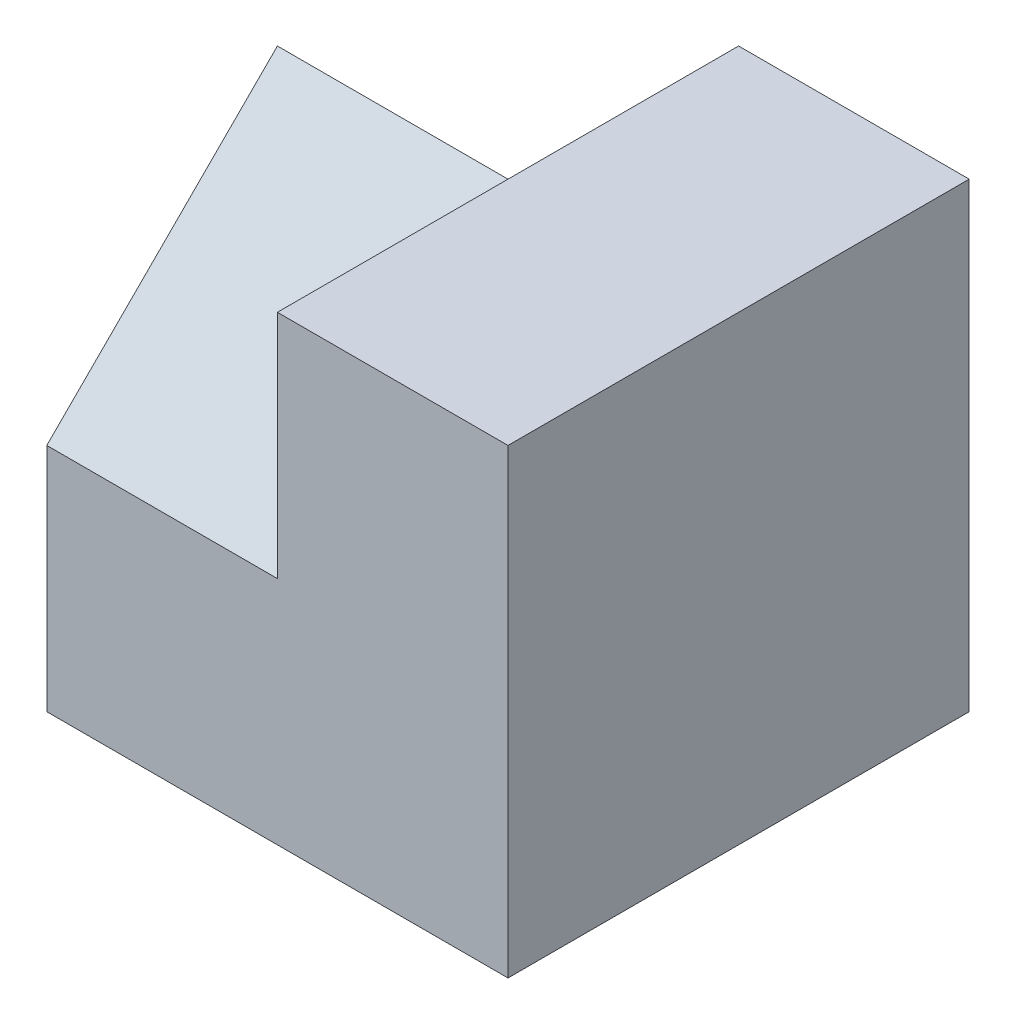
ISO-10303-21;
HEADER;
FILE_DESCRIPTION(('STEP AP214'),'2;1');
FILE_NAME('part.step','',(''),(''),'','','');
FILE_SCHEMA(('AUTOMOTIVE_DESIGN { 1 0 10303 214 1 1 1 1 }'));
ENDSEC;
DATA;
#1=APPLICATION_CONTEXT('core data for automotive mechanical design processes');
#2=APPLICATION_PROTOCOL_DEFINITION('international standard','automotive_design',2000,#1);
#3=PRODUCT_CONTEXT('',#1,'mechanical');
#4=PRODUCT('Part','Part','',(#3));
#5=PRODUCT_RELATED_PRODUCT_CATEGORY('part','',(#4));
#6=PRODUCT_DEFINITION_FORMATION('','',#4);
#7=PRODUCT_DEFINITION_CONTEXT('part definition',#1,'design');
#8=PRODUCT_DEFINITION('design','',#6,#7);
#9=PRODUCT_DEFINITION_SHAPE('','',#8);
#10=(LENGTH_UNIT() NAMED_UNIT(*) SI_UNIT(.MILLI.,.METRE.));
#11=(NAMED_UNIT(*) PLANE_ANGLE_UNIT() SI_UNIT($,.RADIAN.));
#12=(NAMED_UNIT(*) SI_UNIT($,.STERADIAN.) SOLID_ANGLE_UNIT());
#13=UNCERTAINTY_MEASURE_WITH_UNIT(LENGTH_MEASURE(1.E-05),#10,'distance_accuracy_value','');
#14=(GEOMETRIC_REPRESENTATION_CONTEXT(3) GLOBAL_UNCERTAINTY_ASSIGNED_CONTEXT((#13)) GLOBAL_UNIT_ASSIGNED_CONTEXT((#10,
#11,#12)) REPRESENTATION_CONTEXT('',''));
#15=CARTESIAN_POINT('',(0.,0.,0.));
#16=DIRECTION('',(0.,0.,1.));
#17=DIRECTION('',(1.,0.,0.));
#18=AXIS2_PLACEMENT_3D('',#15,#16,#17);
#19=CARTESIAN_POINT('',(-2.,4.,-2.));
#20=DIRECTION('',(0.,0.,1.));
#21=DIRECTION('',(1.,0.,0.));
#22=AXIS2_PLACEMENT_3D('',#19,#20,#21);
#23=PLANE('',#22);
#24=DIRECTION('',(0.,-1.,0.));
#25=VECTOR('',#24,1.);
#26=CARTESIAN_POINT('',(0.,0.,-2.));
#27=LINE('',#26,#25);
#28=CARTESIAN_POINT('',(0.,4.,-2.));
#29=VERTEX_POINT('',#28);
#30=CARTESIAN_POINT('',(0.,2.,-2.));
#31=VERTEX_POINT('',#30);
#32=EDGE_CURVE('E136',#29,#31,#27,.T.);
#33=ORIENTED_EDGE('',*,*,#32,.F.);
#34=DIRECTION('',(-1.,0.,0.));
#35=VECTOR('',#34,1.);
#36=CARTESIAN_POINT('',(-2.,4.,-2.));
#37=LINE('',#36,#35);
#38=CARTESIAN_POINT('',(2.,4.,-2.));
#39=VERTEX_POINT('',#38);
#40=EDGE_CURVE('E145',#39,#29,#37,.T.);
#41=ORIENTED_EDGE('',*,*,#40,.F.);
#42=DIRECTION('',(0.,-1.,0.));
#43=VECTOR('',#42,1.);
#44=CARTESIAN_POINT('',(2.,4.,-2.));
#45=LINE('',#44,#43);
#46=CARTESIAN_POINT('',(2.,0.,-2.));
#47=VERTEX_POINT('',#46);
#48=EDGE_CURVE('E12',#39,#47,#45,.T.);
#49=ORIENTED_EDGE('',*,*,#48,.T.);
#50=DIRECTION('',(-1.,0.,0.));
#51=VECTOR('',#50,1.);
#52=CARTESIAN_POINT('',(-2.,0.,-2.));
#53=LINE('',#52,#51);
#54=CARTESIAN_POINT('',(0.,0.,-2.));
#55=VERTEX_POINT('',#54);
#56=EDGE_CURVE('E168',#47,#55,#53,.T.);
#57=ORIENTED_EDGE('',*,*,#56,.T.);
#58=DIRECTION('',(0.,-1.,0.));
#59=VECTOR('',#58,1.);
#60=CARTESIAN_POINT('',(0.,0.,-2.));
#61=LINE('',#60,#59);
#62=EDGE_CURVE('E73',#31,#55,#61,.T.);
#63=ORIENTED_EDGE('',*,*,#62,.F.);
#64=EDGE_LOOP('',(#33,#41,#49,#57,#63));
#65=FACE_BOUND('',#64,.T.);
#66=ADVANCED_FACE('F50',(#65),#23,.F.);
#67=CARTESIAN_POINT('',(-2.,4.,2.));
#68=DIRECTION('',(1.,0.,0.));
#69=DIRECTION('',(0.,0.,-1.));
#70=AXIS2_PLACEMENT_3D('',#67,#68,#69);
#71=PLANE('',#70);
#72=DIRECTION('',(0.,-0.707106781186548,-0.707106781186548));
#73=VECTOR('',#72,1.);
#74=CARTESIAN_POINT('',(-2.,2.,-2.));
#75=LINE('',#74,#73);
#76=CARTESIAN_POINT('',(-2.,4.,0.));
#77=VERTEX_POINT('',#76);
#78=CARTESIAN_POINT('',(-2.,2.,-2.));
#79=VERTEX_POINT('',#78);
#80=EDGE_CURVE('E124',#77,#79,#75,.T.);
#81=ORIENTED_EDGE('',*,*,#80,.T.);
#82=DIRECTION('',(0.,-0.707106781186548,0.707106781186548));
#83=VECTOR('',#82,1.);
#84=CARTESIAN_POINT('',(-2.,0.,0.));
#85=LINE('',#84,#83);
#86=CARTESIAN_POINT('',(-2.,0.,0.));
#87=VERTEX_POINT('',#86);
#88=EDGE_CURVE('E186',#79,#87,#85,.T.);
#89=ORIENTED_EDGE('',*,*,#88,.T.);
#90=DIRECTION('',(0.,0.,1.));
#91=VECTOR('',#90,1.);
#92=CARTESIAN_POINT('',(-2.,0.,2.));
#93=LINE('',#92,#91);
#94=CARTESIAN_POINT('',(-2.,0.,2.));
#95=VERTEX_POINT('',#94);
#96=EDGE_CURVE('E171',#87,#95,#93,.T.);
#97=ORIENTED_EDGE('',*,*,#96,.T.);
#98=DIRECTION('',(0.,-1.,0.));
#99=VECTOR('',#98,1.);
#100=CARTESIAN_POINT('',(-2.,4.,2.));
#101=LINE('',#100,#99);
#102=CARTESIAN_POINT('',(-2.,2.,2.));
#103=VERTEX_POINT('',#102);
#104=EDGE_CURVE('E58',#103,#95,#101,.T.);
#105=ORIENTED_EDGE('',*,*,#104,.F.);
#106=DIRECTION('',(0.,0.707106781186548,-0.707106781186548));
#107=VECTOR('',#106,1.);
#108=CARTESIAN_POINT('',(-2.,2.,2.));
#109=LINE('',#108,#107);
#110=EDGE_CURVE('E150',#103,#77,#109,.T.);
#111=ORIENTED_EDGE('',*,*,#110,.T.);
#112=EDGE_LOOP('',(#81,#89,#97,#105,#111));
#113=FACE_BOUND('',#112,.T.);
#114=ADVANCED_FACE('F184',(#113),#71,.F.);
#115=CARTESIAN_POINT('',(0.,4.,0.));
#116=DIRECTION('',(0.,-1.,0.));
#117=DIRECTION('',(0.,0.,-1.));
#118=AXIS2_PLACEMENT_3D('',#115,#116,#117);
#119=PLANE('',#118);
#120=DIRECTION('',(0.,0.,-1.));
#121=VECTOR('',#120,1.);
#122=CARTESIAN_POINT('',(0.,4.,0.));
#123=LINE('',#122,#121);
#124=CARTESIAN_POINT('',(0.,4.,0.));
#125=VERTEX_POINT('',#124);
#126=EDGE_CURVE('E134',#125,#29,#123,.T.);
#127=ORIENTED_EDGE('',*,*,#126,.F.);
#128=DIRECTION('',(0.,0.,-1.));
#129=VECTOR('',#128,1.);
#130=CARTESIAN_POINT('',(0.,4.,0.));
#131=LINE('',#130,#129);
#132=CARTESIAN_POINT('',(0.,4.,2.));
#133=VERTEX_POINT('',#132);
#134=EDGE_CURVE('E142',#133,#125,#131,.T.);
#135=ORIENTED_EDGE('',*,*,#134,.F.);
#136=DIRECTION('',(1.,0.,0.));
#137=VECTOR('',#136,1.);
#138=CARTESIAN_POINT('',(-2.,4.,2.));
#139=LINE('',#138,#137);
#140=CARTESIAN_POINT('',(2.,4.,2.));
#141=VERTEX_POINT('',#140);
#142=EDGE_CURVE('E163',#133,#141,#139,.T.);
#143=ORIENTED_EDGE('',*,*,#142,.T.);
#144=DIRECTION('',(0.,0.,-1.));
#145=VECTOR('',#144,1.);
#146=CARTESIAN_POINT('',(2.,4.,2.));
#147=LINE('',#146,#145);
#148=EDGE_CURVE('E159',#141,#39,#147,.T.);
#149=ORIENTED_EDGE('',*,*,#148,.T.);
#150=ORIENTED_EDGE('',*,*,#40,.T.);
#151=EDGE_LOOP('',(#127,#135,#143,#149,#150));
#152=FACE_BOUND('',#151,.T.);
#153=ADVANCED_FACE('F141',(#152),#119,.F.);
#154=CARTESIAN_POINT('',(-2.,4.,2.));
#155=DIRECTION('',(0.,0.,-1.));
#156=DIRECTION('',(-1.,0.,0.));
#157=AXIS2_PLACEMENT_3D('',#154,#155,#156);
#158=PLANE('',#157);
#159=DIRECTION('',(-1.,0.,0.));
#160=VECTOR('',#159,1.);
#161=CARTESIAN_POINT('',(0.,2.,2.));
#162=LINE('',#161,#160);
#163=CARTESIAN_POINT('',(0.,2.,2.));
#164=VERTEX_POINT('',#163);
#165=EDGE_CURVE('E129',#164,#103,#162,.T.);
#166=ORIENTED_EDGE('',*,*,#165,.T.);
#167=ORIENTED_EDGE('',*,*,#104,.T.);
#168=DIRECTION('',(1.,0.,0.));
#169=VECTOR('',#168,1.);
#170=CARTESIAN_POINT('',(-2.,0.,2.));
#171=LINE('',#170,#169);
#172=CARTESIAN_POINT('',(2.,0.,2.));
#173=VERTEX_POINT('',#172);
#174=EDGE_CURVE('E161',#95,#173,#171,.T.);
#175=ORIENTED_EDGE('',*,*,#174,.T.);
#176=DIRECTION('',(0.,-1.,0.));
#177=VECTOR('',#176,1.);
#178=CARTESIAN_POINT('',(2.,4.,2.));
#179=LINE('',#178,#177);
#180=EDGE_CURVE('E165',#141,#173,#179,.T.);
#181=ORIENTED_EDGE('',*,*,#180,.F.);
#182=ORIENTED_EDGE('',*,*,#142,.F.);
#183=DIRECTION('',(0.,1.,0.));
#184=VECTOR('',#183,1.);
#185=CARTESIAN_POINT('',(0.,0.,2.));
#186=LINE('',#185,#184);
#187=EDGE_CURVE('E65',#164,#133,#186,.T.);
#188=ORIENTED_EDGE('',*,*,#187,.F.);
#189=EDGE_LOOP('',(#166,#167,#175,#181,#182,#188));
#190=FACE_BOUND('',#189,.T.);
#191=ADVANCED_FACE('F178',(#190),#158,.F.);
#192=CARTESIAN_POINT('',(0.,0.,0.));
#193=DIRECTION('',(0.,-1.,0.));
#194=DIRECTION('',(0.,0.,-1.));
#195=AXIS2_PLACEMENT_3D('',#192,#193,#194);
#196=PLANE('',#195);
#197=ORIENTED_EDGE('',*,*,#96,.F.);
#198=DIRECTION('',(-1.,0.,0.));
#199=VECTOR('',#198,1.);
#200=CARTESIAN_POINT('',(0.,0.,0.));
#201=LINE('',#200,#199);
#202=CARTESIAN_POINT('',(0.,0.,0.));
#203=VERTEX_POINT('',#202);
#204=EDGE_CURVE('E157',#203,#87,#201,.T.);
#205=ORIENTED_EDGE('',*,*,#204,.F.);
#206=DIRECTION('',(0.,0.,1.));
#207=VECTOR('',#206,1.);
#208=CARTESIAN_POINT('',(0.,0.,0.));
#209=LINE('',#208,#207);
#210=EDGE_CURVE('E202',#55,#203,#209,.T.);
#211=ORIENTED_EDGE('',*,*,#210,.F.);
#212=ORIENTED_EDGE('',*,*,#56,.F.);
#213=DIRECTION('',(0.,0.,-1.));
#214=VECTOR('',#213,1.);
#215=CARTESIAN_POINT('',(2.,0.,2.));
#216=LINE('',#215,#214);
#217=EDGE_CURVE('E128',#173,#47,#216,.T.);
#218=ORIENTED_EDGE('',*,*,#217,.F.);
#219=ORIENTED_EDGE('',*,*,#174,.F.);
#220=EDGE_LOOP('',(#197,#205,#211,#212,#218,#219));
#221=FACE_BOUND('',#220,.T.);
#222=ADVANCED_FACE('F190',(#221),#196,.T.);
#223=CARTESIAN_POINT('',(2.,4.,2.));
#224=DIRECTION('',(-1.,0.,0.));
#225=DIRECTION('',(0.,0.,1.));
#226=AXIS2_PLACEMENT_3D('',#223,#224,#225);
#227=PLANE('',#226);
#228=ORIENTED_EDGE('',*,*,#217,.T.);
#229=ORIENTED_EDGE('',*,*,#48,.F.);
#230=ORIENTED_EDGE('',*,*,#148,.F.);
#231=ORIENTED_EDGE('',*,*,#180,.T.);
#232=EDGE_LOOP('',(#228,#229,#230,#231));
#233=FACE_BOUND('',#232,.T.);
#234=ADVANCED_FACE('F52',(#233),#227,.F.);
#235=CARTESIAN_POINT('',(0.,0.,0.));
#236=DIRECTION('',(0.,-0.707106781186547,-0.707106781186547));
#237=DIRECTION('',(0.,0.707106781186548,-0.707106781186548));
#238=AXIS2_PLACEMENT_3D('',#235,#236,#237);
#239=PLANE('',#238);
#240=ORIENTED_EDGE('',*,*,#88,.F.);
#241=DIRECTION('',(-1.,0.,0.));
#242=VECTOR('',#241,1.);
#243=CARTESIAN_POINT('',(0.,2.,-2.));
#244=LINE('',#243,#242);
#245=EDGE_CURVE('E203',#31,#79,#244,.T.);
#246=ORIENTED_EDGE('',*,*,#245,.F.);
#247=DIRECTION('',(0.,-0.707106781186548,0.707106781186548));
#248=VECTOR('',#247,1.);
#249=CARTESIAN_POINT('',(0.,0.,0.));
#250=LINE('',#249,#248);
#251=EDGE_CURVE('E196',#31,#203,#250,.T.);
#252=ORIENTED_EDGE('',*,*,#251,.T.);
#253=ORIENTED_EDGE('',*,*,#204,.T.);
#254=EDGE_LOOP('',(#240,#246,#252,#253));
#255=FACE_BOUND('',#254,.T.);
#256=ADVANCED_FACE('F207',(#255),#239,.T.);
#257=CARTESIAN_POINT('',(0.,0.,0.));
#258=DIRECTION('',(-1.,0.,0.));
#259=DIRECTION('',(0.,0.,1.));
#260=AXIS2_PLACEMENT_3D('',#257,#258,#259);
#261=PLANE('',#260);
#262=ORIENTED_EDGE('',*,*,#251,.F.);
#263=ORIENTED_EDGE('',*,*,#62,.T.);
#264=ORIENTED_EDGE('',*,*,#210,.T.);
#265=EDGE_LOOP('',(#262,#263,#264));
#266=FACE_BOUND('',#265,.T.);
#267=ADVANCED_FACE('F208',(#266),#261,.T.);
#268=CARTESIAN_POINT('',(0.,2.,2.));
#269=DIRECTION('',(0.,0.707106781186547,0.707106781186547));
#270=DIRECTION('',(0.,-0.707106781186548,0.707106781186548));
#271=AXIS2_PLACEMENT_3D('',#268,#269,#270);
#272=PLANE('',#271);
#273=ORIENTED_EDGE('',*,*,#110,.F.);
#274=ORIENTED_EDGE('',*,*,#165,.F.);
#275=DIRECTION('',(0.,0.707106781186548,-0.707106781186548));
#276=VECTOR('',#275,1.);
#277=CARTESIAN_POINT('',(0.,2.,2.));
#278=LINE('',#277,#276);
#279=EDGE_CURVE('E147',#164,#125,#278,.T.);
#280=ORIENTED_EDGE('',*,*,#279,.T.);
#281=DIRECTION('',(-1.,0.,0.));
#282=VECTOR('',#281,1.);
#283=CARTESIAN_POINT('',(0.,4.,0.));
#284=LINE('',#283,#282);
#285=EDGE_CURVE('E118',#125,#77,#284,.T.);
#286=ORIENTED_EDGE('',*,*,#285,.T.);
#287=EDGE_LOOP('',(#273,#274,#280,#286));
#288=FACE_BOUND('',#287,.T.);
#289=ADVANCED_FACE('F148',(#288),#272,.T.);
#290=CARTESIAN_POINT('',(0.,0.,0.));
#291=DIRECTION('',(-1.,0.,0.));
#292=DIRECTION('',(0.,0.,1.));
#293=AXIS2_PLACEMENT_3D('',#290,#291,#292);
#294=PLANE('',#293);
#295=ORIENTED_EDGE('',*,*,#279,.F.);
#296=ORIENTED_EDGE('',*,*,#187,.T.);
#297=ORIENTED_EDGE('',*,*,#134,.T.);
#298=EDGE_LOOP('',(#295,#296,#297));
#299=FACE_BOUND('',#298,.T.);
#300=ADVANCED_FACE('F152',(#299),#294,.T.);
#301=CARTESIAN_POINT('',(0.,2.,-2.));
#302=DIRECTION('',(0.,0.707106781186547,-0.707106781186547));
#303=DIRECTION('',(0.,0.707106781186548,0.707106781186548));
#304=AXIS2_PLACEMENT_3D('',#301,#302,#303);
#305=PLANE('',#304);
#306=ORIENTED_EDGE('',*,*,#80,.F.);
#307=ORIENTED_EDGE('',*,*,#285,.F.);
#308=DIRECTION('',(0.,-0.707106781186548,-0.707106781186548));
#309=VECTOR('',#308,1.);
#310=CARTESIAN_POINT('',(0.,2.,-2.));
#311=LINE('',#310,#309);
#312=EDGE_CURVE('E121',#125,#31,#311,.T.);
#313=ORIENTED_EDGE('',*,*,#312,.T.);
#314=ORIENTED_EDGE('',*,*,#245,.T.);
#315=EDGE_LOOP('',(#306,#307,#313,#314));
#316=FACE_BOUND('',#315,.T.);
#317=ADVANCED_FACE('F120',(#316),#305,.T.);
#318=CARTESIAN_POINT('',(0.,0.,0.));
#319=DIRECTION('',(-1.,0.,0.));
#320=DIRECTION('',(0.,0.,1.));
#321=AXIS2_PLACEMENT_3D('',#318,#319,#320);
#322=PLANE('',#321);
#323=ORIENTED_EDGE('',*,*,#312,.F.);
#324=ORIENTED_EDGE('',*,*,#126,.T.);
#325=ORIENTED_EDGE('',*,*,#32,.T.);
#326=EDGE_LOOP('',(#323,#324,#325));
#327=FACE_BOUND('',#326,.T.);
#328=ADVANCED_FACE('F133',(#327),#322,.T.);
#329=CLOSED_SHELL('',(#66,#114,#153,#191,#222,#234,#256,#267,#289,#300,#317,#328));
#330=MANIFOLD_SOLID_BREP('B2',#329);
#331=ADVANCED_BREP_SHAPE_REPRESENTATION('',(#18,#330),#14);
#332=SHAPE_DEFINITION_REPRESENTATION(#9,#331);
ENDSEC;
END-ISO-10303-21;
